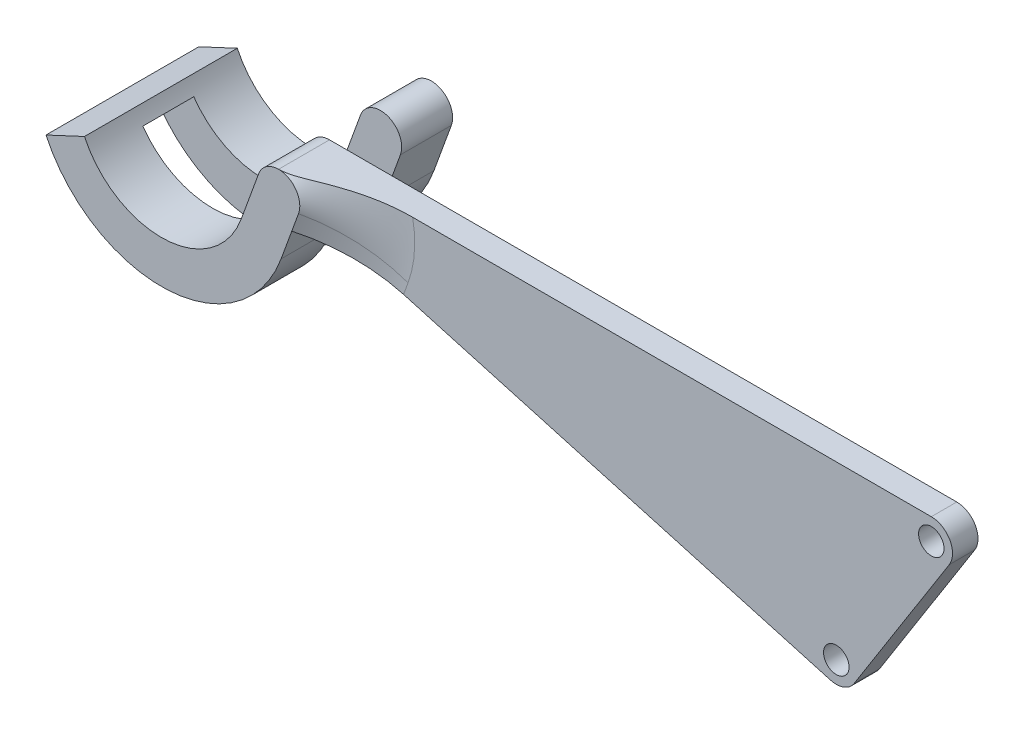
ISO-10303-21;
HEADER;
FILE_DESCRIPTION(('STEP AP214'),'2;1');
FILE_NAME('part.step','',(''),(''),'','','');
FILE_SCHEMA(('AUTOMOTIVE_DESIGN { 1 0 10303 214 1 1 1 1 }'));
ENDSEC;
DATA;
#1=APPLICATION_CONTEXT('core data for automotive mechanical design processes');
#2=APPLICATION_PROTOCOL_DEFINITION('international standard','automotive_design',2000,#1);
#3=PRODUCT_CONTEXT('',#1,'mechanical');
#4=PRODUCT('Part','Part','',(#3));
#5=PRODUCT_RELATED_PRODUCT_CATEGORY('part','',(#4));
#6=PRODUCT_DEFINITION_FORMATION('','',#4);
#7=PRODUCT_DEFINITION_CONTEXT('part definition',#1,'design');
#8=PRODUCT_DEFINITION('design','',#6,#7);
#9=PRODUCT_DEFINITION_SHAPE('','',#8);
#10=(LENGTH_UNIT() NAMED_UNIT(*) SI_UNIT(.MILLI.,.METRE.));
#11=(NAMED_UNIT(*) PLANE_ANGLE_UNIT() SI_UNIT($,.RADIAN.));
#12=(NAMED_UNIT(*) SI_UNIT($,.STERADIAN.) SOLID_ANGLE_UNIT());
#13=UNCERTAINTY_MEASURE_WITH_UNIT(LENGTH_MEASURE(1.E-05),#10,'distance_accuracy_value','');
#14=(GEOMETRIC_REPRESENTATION_CONTEXT(3) GLOBAL_UNCERTAINTY_ASSIGNED_CONTEXT((#13)) GLOBAL_UNIT_ASSIGNED_CONTEXT((#10,
#11,#12)) REPRESENTATION_CONTEXT('',''));
#15=CARTESIAN_POINT('',(0.,0.,0.));
#16=DIRECTION('',(0.,0.,1.));
#17=DIRECTION('',(1.,0.,0.));
#18=AXIS2_PLACEMENT_3D('',#15,#16,#17);
#19=CARTESIAN_POINT('',(-1.17461577598238,0.427525179157091,-6.75));
#20=DIRECTION('',(-0.939692620785907,0.342020143325673,0.));
#21=DIRECTION('',(-0.342020143325673,-0.939692620785907,0.));
#22=AXIS2_PLACEMENT_3D('',#19,#20,#21);
#23=PLANE('',#22);
#24=DIRECTION('',(0.,0.,1.));
#25=VECTOR('',#24,1.);
#26=CARTESIAN_POINT('',(-1.17461577598238,0.427525179157091,-6.75));
#27=LINE('',#26,#25);
#28=CARTESIAN_POINT('',(-1.17461577598238,0.427525179157091,-0.75));
#29=VERTEX_POINT('',#28);
#30=CARTESIAN_POINT('',(-1.17461577598238,0.427525179157091,2.25));
#31=VERTEX_POINT('',#30);
#32=EDGE_CURVE('E211',#29,#31,#27,.T.);
#33=ORIENTED_EDGE('',*,*,#32,.F.);
#34=DIRECTION('',(0.342020143325673,0.939692620785907,0.));
#35=VECTOR('',#34,1.);
#36=CARTESIAN_POINT('',(-1.17461577598238,0.427525179157091,-0.75));
#37=LINE('',#36,#35);
#38=CARTESIAN_POINT('',(-2.2006762059594,-2.39155268320063,-0.75));
#39=VERTEX_POINT('',#38);
#40=EDGE_CURVE('E357',#39,#29,#37,.T.);
#41=ORIENTED_EDGE('',*,*,#40,.F.);
#42=DIRECTION('',(0.,0.,1.));
#43=VECTOR('',#42,1.);
#44=CARTESIAN_POINT('',(-2.2006762059594,-2.39155268320063,-6.75));
#45=LINE('',#44,#43);
#46=CARTESIAN_POINT('',(-2.2006762059594,-2.39155268320063,2.25));
#47=VERTEX_POINT('',#46);
#48=EDGE_CURVE('E195',#39,#47,#45,.T.);
#49=ORIENTED_EDGE('',*,*,#48,.T.);
#50=DIRECTION('',(-0.342020143325673,-0.939692620785907,0.));
#51=VECTOR('',#50,1.);
#52=CARTESIAN_POINT('',(-1.17461577598238,0.427525179157091,2.25));
#53=LINE('',#52,#51);
#54=EDGE_CURVE('E373',#31,#47,#53,.T.);
#55=ORIENTED_EDGE('',*,*,#54,.F.);
#56=EDGE_LOOP('',(#33,#41,#49,#55));
#57=FACE_BOUND('',#56,.T.);
#58=ADVANCED_FACE('F34',(#57),#23,.T.);
#59=CARTESIAN_POINT('',(1.17461577598238,-0.427525179157091,-6.75));
#60=DIRECTION('',(0.939692620785907,-0.342020143325673,0.));
#61=DIRECTION('',(0.342020143325673,0.939692620785907,0.));
#62=AXIS2_PLACEMENT_3D('',#59,#60,#61);
#63=PLANE('',#62);
#64=DIRECTION('',(0.,0.,-1.));
#65=VECTOR('',#64,1.);
#66=CARTESIAN_POINT('',(0.777572027577552,-1.51839391243497,0.75));
#67=LINE('',#66,#65);
#68=CARTESIAN_POINT('',(0.777572027577552,-1.51839391243497,2.25));
#69=VERTEX_POINT('',#68);
#70=CARTESIAN_POINT('',(0.777572027577552,-1.51839391243497,-0.75));
#71=VERTEX_POINT('',#70);
#72=EDGE_CURVE('E214',#69,#71,#67,.T.);
#73=ORIENTED_EDGE('',*,*,#72,.F.);
#74=DIRECTION('',(0.342020143325673,0.939692620785907,0.));
#75=VECTOR('',#74,1.);
#76=CARTESIAN_POINT('',(1.17461577598238,-0.427525179157091,2.25));
#77=LINE('',#76,#75);
#78=CARTESIAN_POINT('',(0.148555346005365,-3.24660304151481,2.25));
#79=VERTEX_POINT('',#78);
#80=EDGE_CURVE('E375',#79,#69,#77,.T.);
#81=ORIENTED_EDGE('',*,*,#80,.F.);
#82=DIRECTION('',(0.,0.,1.));
#83=VECTOR('',#82,1.);
#84=CARTESIAN_POINT('',(0.148555346005365,-3.24660304151481,-6.75));
#85=LINE('',#84,#83);
#86=CARTESIAN_POINT('',(0.148555346005365,-3.24660304151481,-0.75));
#87=VERTEX_POINT('',#86);
#88=EDGE_CURVE('E204',#87,#79,#85,.T.);
#89=ORIENTED_EDGE('',*,*,#88,.F.);
#90=DIRECTION('',(-0.342020143325673,-0.939692620785907,0.));
#91=VECTOR('',#90,1.);
#92=CARTESIAN_POINT('',(0.148555346005365,-3.24660304151481,-0.75));
#93=LINE('',#92,#91);
#94=EDGE_CURVE('E358',#71,#87,#93,.T.);
#95=ORIENTED_EDGE('',*,*,#94,.F.);
#96=EDGE_LOOP('',(#73,#81,#89,#95));
#97=FACE_BOUND('',#96,.T.);
#98=ADVANCED_FACE('F312',(#97),#63,.T.);
#99=CARTESIAN_POINT('',(0.,0.,0.75));
#100=DIRECTION('',(0.,0.,-1.));
#101=DIRECTION('',(-1.,0.,0.));
#102=AXIS2_PLACEMENT_3D('',#99,#100,#101);
#103=CYLINDRICAL_SURFACE('',#102,1.25);
#104=CARTESIAN_POINT('',(0.,0.,2.25));
#105=DIRECTION('',(0.,0.,-1.));
#106=DIRECTION('',(-1.,0.,0.));
#107=AXIS2_PLACEMENT_3D('',#104,#105,#106);
#108=CIRCLE('',#107,1.25);
#109=CARTESIAN_POINT('',(0.,1.25,2.25));
#110=VERTEX_POINT('',#109);
#111=EDGE_CURVE('E337',#31,#110,#108,.T.);
#112=ORIENTED_EDGE('',*,*,#111,.T.);
#113=DIRECTION('',(0.,0.,-1.));
#114=VECTOR('',#113,1.);
#115=CARTESIAN_POINT('',(0.,1.25,0.75));
#116=LINE('',#115,#114);
#117=CARTESIAN_POINT('',(0.,1.25,-0.75));
#118=VERTEX_POINT('',#117);
#119=EDGE_CURVE('E50',#110,#118,#116,.T.);
#120=ORIENTED_EDGE('',*,*,#119,.T.);
#121=CARTESIAN_POINT('',(0.,0.,-0.75));
#122=DIRECTION('',(0.,0.,-1.));
#123=DIRECTION('',(-1.,0.,0.));
#124=AXIS2_PLACEMENT_3D('',#121,#122,#123);
#125=CIRCLE('',#124,1.25);
#126=EDGE_CURVE('E355',#29,#118,#125,.T.);
#127=ORIENTED_EDGE('',*,*,#126,.F.);
#128=ORIENTED_EDGE('',*,*,#32,.T.);
#129=EDGE_LOOP('',(#112,#120,#127,#128));
#130=FACE_BOUND('',#129,.T.);
#131=ADVANCED_FACE('F302',(#130),#103,.T.);
#132=DIRECTION('',(0.342020143325673,0.939692620785907,0.));
#133=VECTOR('',#132,1.);
#134=CARTESIAN_POINT('',(-1.17461577598238,0.427525179157091,-3.75));
#135=LINE('',#134,#133);
#136=CARTESIAN_POINT('',(-2.2006762059594,-2.39155268320063,-3.75));
#137=VERTEX_POINT('',#136);
#138=CARTESIAN_POINT('',(-1.17461577598238,0.427525179157091,-3.75));
#139=VERTEX_POINT('',#138);
#140=EDGE_CURVE('E168',#137,#139,#135,.T.);
#141=ORIENTED_EDGE('',*,*,#140,.T.);
#142=CARTESIAN_POINT('',(-1.17461577598238,0.427525179157091,-6.75));
#143=VERTEX_POINT('',#142);
#144=EDGE_CURVE('E212',#143,#139,#27,.T.);
#145=ORIENTED_EDGE('',*,*,#144,.F.);
#146=DIRECTION('',(-0.342020143325673,-0.939692620785907,0.));
#147=VECTOR('',#146,1.);
#148=CARTESIAN_POINT('',(-1.17461577598238,0.427525179157091,-6.75));
#149=LINE('',#148,#147);
#150=CARTESIAN_POINT('',(-2.2006762059594,-2.39155268320063,-6.75));
#151=VERTEX_POINT('',#150);
#152=EDGE_CURVE('E192',#143,#151,#149,.T.);
#153=ORIENTED_EDGE('',*,*,#152,.T.);
#154=EDGE_CURVE('E183',#151,#137,#45,.T.);
#155=ORIENTED_EDGE('',*,*,#154,.T.);
#156=EDGE_LOOP('',(#141,#145,#153,#155));
#157=FACE_BOUND('',#156,.T.);
#158=ADVANCED_FACE('F190',(#157),#23,.T.);
#159=DIRECTION('',(-0.342020143325673,-0.939692620785907,0.));
#160=VECTOR('',#159,1.);
#161=CARTESIAN_POINT('',(0.148555346005365,-3.24660304151481,-3.75));
#162=LINE('',#161,#160);
#163=CARTESIAN_POINT('',(1.17461577598238,-0.427525179157091,-3.75));
#164=VERTEX_POINT('',#163);
#165=CARTESIAN_POINT('',(0.148555346005365,-3.24660304151481,-3.75));
#166=VERTEX_POINT('',#165);
#167=EDGE_CURVE('E414',#164,#166,#162,.T.);
#168=ORIENTED_EDGE('',*,*,#167,.T.);
#169=CARTESIAN_POINT('',(0.148555346005365,-3.24660304151481,-6.75));
#170=VERTEX_POINT('',#169);
#171=EDGE_CURVE('E205',#170,#166,#85,.T.);
#172=ORIENTED_EDGE('',*,*,#171,.F.);
#173=DIRECTION('',(0.342020143325673,0.939692620785907,0.));
#174=VECTOR('',#173,1.);
#175=CARTESIAN_POINT('',(1.17461577598238,-0.427525179157091,-6.75));
#176=LINE('',#175,#174);
#177=CARTESIAN_POINT('',(1.17461577598238,-0.427525179157091,-6.75));
#178=VERTEX_POINT('',#177);
#179=EDGE_CURVE('E390',#170,#178,#176,.T.);
#180=ORIENTED_EDGE('',*,*,#179,.T.);
#181=DIRECTION('',(0.,0.,1.));
#182=VECTOR('',#181,1.);
#183=CARTESIAN_POINT('',(1.17461577598238,-0.427525179157091,-6.75));
#184=LINE('',#183,#182);
#185=EDGE_CURVE('E208',#178,#164,#184,.T.);
#186=ORIENTED_EDGE('',*,*,#185,.T.);
#187=EDGE_LOOP('',(#168,#172,#180,#186));
#188=FACE_BOUND('',#187,.T.);
#189=ADVANCED_FACE('F321',(#188),#63,.T.);
#190=CARTESIAN_POINT('',(-6.89913930988894,-0.681451966572266,-6.75));
#191=DIRECTION('',(0.,0.,1.));
#192=DIRECTION('',(1.,0.,0.));
#193=AXIS2_PLACEMENT_3D('',#190,#191,#192);
#194=CYLINDRICAL_SURFACE('',#193,7.5);
#195=ORIENTED_EDGE('',*,*,#171,.T.);
#196=CARTESIAN_POINT('',(-6.89913930988894,-0.681451966572266,-3.75));
#197=DIRECTION('',(0.,0.,-1.));
#198=DIRECTION('',(-1.,0.,0.));
#199=AXIS2_PLACEMENT_3D('',#196,#197,#198);
#200=CIRCLE('',#199,7.5);
#201=CARTESIAN_POINT('',(-13.0427796420564,-4.98327523920506,-3.75));
#202=VERTEX_POINT('',#201);
#203=EDGE_CURVE('E411',#166,#202,#200,.T.);
#204=ORIENTED_EDGE('',*,*,#203,.T.);
#205=DIRECTION('',(0.,0.,1.));
#206=VECTOR('',#205,1.);
#207=CARTESIAN_POINT('',(-13.0427796420564,-4.98327523920506,-3.75));
#208=LINE('',#207,#206);
#209=CARTESIAN_POINT('',(-13.0427796420564,-4.98327523920506,-0.75));
#210=VERTEX_POINT('',#209);
#211=EDGE_CURVE('E369',#202,#210,#208,.T.);
#212=ORIENTED_EDGE('',*,*,#211,.T.);
#213=CARTESIAN_POINT('',(-6.89913930988894,-0.681451966572266,-0.75));
#214=DIRECTION('',(0.,0.,-1.));
#215=DIRECTION('',(-1.,0.,0.));
#216=AXIS2_PLACEMENT_3D('',#213,#214,#215);
#217=CIRCLE('',#216,7.5);
#218=EDGE_CURVE('E360',#87,#210,#217,.T.);
#219=ORIENTED_EDGE('',*,*,#218,.F.);
#220=ORIENTED_EDGE('',*,*,#88,.T.);
#221=CARTESIAN_POINT('',(-6.89913930988894,-0.681451966572266,2.25));
#222=DIRECTION('',(0.,0.,-1.));
#223=DIRECTION('',(-1.,0.,0.));
#224=AXIS2_PLACEMENT_3D('',#221,#222,#223);
#225=CIRCLE('',#224,7.5);
#226=CARTESIAN_POINT('',(-13.6964477126638,-3.85108892962745,2.25));
#227=VERTEX_POINT('',#226);
#228=EDGE_CURVE('E378',#79,#227,#225,.T.);
#229=ORIENTED_EDGE('',*,*,#228,.T.);
#230=DIRECTION('',(0.,0.,1.));
#231=VECTOR('',#230,1.);
#232=CARTESIAN_POINT('',(-13.6964477126638,-3.85108892962745,-6.75));
#233=LINE('',#232,#231);
#234=CARTESIAN_POINT('',(-13.6964477126638,-3.85108892962745,-6.75));
#235=VERTEX_POINT('',#234);
#236=EDGE_CURVE('E197',#235,#227,#233,.T.);
#237=ORIENTED_EDGE('',*,*,#236,.F.);
#238=CARTESIAN_POINT('',(-6.89913930988894,-0.681451966572266,-6.75));
#239=DIRECTION('',(0.,0.,-1.));
#240=DIRECTION('',(-1.,0.,0.));
#241=AXIS2_PLACEMENT_3D('',#238,#239,#240);
#242=CIRCLE('',#241,7.5);
#243=EDGE_CURVE('E393',#170,#235,#242,.T.);
#244=ORIENTED_EDGE('',*,*,#243,.F.);
#245=EDGE_LOOP('',(#195,#204,#212,#219,#220,#229,#237,#244));
#246=FACE_BOUND('',#245,.T.);
#247=ADVANCED_FACE('F329',(#246),#194,.T.);
#248=CARTESIAN_POINT('',(-0.971217775872857,2.08278324168129,-6.75));
#249=DIRECTION('',(-0.422618261740691,0.906307787036654,0.));
#250=DIRECTION('',(-0.906307787036654,-0.422618261740691,0.));
#251=AXIS2_PLACEMENT_3D('',#248,#249,#250);
#252=PLANE('',#251);
#253=ORIENTED_EDGE('',*,*,#236,.T.);
#254=DIRECTION('',(-0.906307787036654,-0.422618261740691,0.));
#255=VECTOR('',#254,1.);
#256=CARTESIAN_POINT('',(-0.971217775872857,2.08278324168129,2.25));
#257=LINE('',#256,#255);
#258=CARTESIAN_POINT('',(-11.4306782450722,-2.79454327527572,2.25));
#259=VERTEX_POINT('',#258);
#260=EDGE_CURVE('E381',#259,#227,#257,.T.);
#261=ORIENTED_EDGE('',*,*,#260,.F.);
#262=DIRECTION('',(0.,0.,1.));
#263=VECTOR('',#262,1.);
#264=CARTESIAN_POINT('',(-11.4306782450722,-2.79454327527572,-6.75));
#265=LINE('',#264,#263);
#266=CARTESIAN_POINT('',(-11.4306782450722,-2.79454327527572,-6.75));
#267=VERTEX_POINT('',#266);
#268=EDGE_CURVE('E194',#267,#259,#265,.T.);
#269=ORIENTED_EDGE('',*,*,#268,.F.);
#270=DIRECTION('',(-0.906307787036654,-0.422618261740691,0.));
#271=VECTOR('',#270,1.);
#272=CARTESIAN_POINT('',(-0.971217775872857,2.08278324168129,-6.75));
#273=LINE('',#272,#271);
#274=EDGE_CURVE('E394',#267,#235,#273,.T.);
#275=ORIENTED_EDGE('',*,*,#274,.T.);
#276=EDGE_LOOP('',(#253,#261,#269,#275));
#277=FACE_BOUND('',#276,.T.);
#278=ADVANCED_FACE('F407',(#277),#252,.T.);
#279=CARTESIAN_POINT('',(-6.89913930988894,-0.681451966572266,-6.75));
#280=DIRECTION('',(0.,0.,1.));
#281=DIRECTION('',(1.,0.,0.));
#282=AXIS2_PLACEMENT_3D('',#279,#280,#281);
#283=CYLINDRICAL_SURFACE('',#282,5.);
#284=CARTESIAN_POINT('',(-6.89913930988894,-0.681451966572266,-3.75));
#285=DIRECTION('',(0.,0.,1.));
#286=DIRECTION('',(-1.,0.,0.));
#287=AXIS2_PLACEMENT_3D('',#284,#285,#286);
#288=CIRCLE('',#287,5.);
#289=CARTESIAN_POINT('',(-10.9948995313339,-3.54933414832746,-3.75));
#290=VERTEX_POINT('',#289);
#291=EDGE_CURVE('E172',#290,#137,#288,.T.);
#292=ORIENTED_EDGE('',*,*,#291,.T.);
#293=ORIENTED_EDGE('',*,*,#154,.F.);
#294=CARTESIAN_POINT('',(-6.89913930988894,-0.681451966572266,-6.75));
#295=DIRECTION('',(0.,0.,-1.));
#296=DIRECTION('',(-1.,0.,0.));
#297=AXIS2_PLACEMENT_3D('',#294,#295,#296);
#298=CIRCLE('',#297,5.);
#299=EDGE_CURVE('E199',#151,#267,#298,.T.);
#300=ORIENTED_EDGE('',*,*,#299,.T.);
#301=ORIENTED_EDGE('',*,*,#268,.T.);
#302=CARTESIAN_POINT('',(-6.89913930988894,-0.681451966572266,2.25));
#303=DIRECTION('',(0.,0.,-1.));
#304=DIRECTION('',(-1.,0.,0.));
#305=AXIS2_PLACEMENT_3D('',#302,#303,#304);
#306=CIRCLE('',#305,5.);
#307=EDGE_CURVE('E384',#47,#259,#306,.T.);
#308=ORIENTED_EDGE('',*,*,#307,.F.);
#309=ORIENTED_EDGE('',*,*,#48,.F.);
#310=CARTESIAN_POINT('',(-6.89913930988894,-0.681451966572266,-0.75));
#311=DIRECTION('',(0.,0.,1.));
#312=DIRECTION('',(-1.,0.,0.));
#313=AXIS2_PLACEMENT_3D('',#310,#311,#312);
#314=CIRCLE('',#313,5.);
#315=CARTESIAN_POINT('',(-10.9948995313339,-3.54933414832746,-0.75));
#316=VERTEX_POINT('',#315);
#317=EDGE_CURVE('E362',#316,#39,#314,.T.);
#318=ORIENTED_EDGE('',*,*,#317,.F.);
#319=DIRECTION('',(0.,0.,1.));
#320=VECTOR('',#319,1.);
#321=CARTESIAN_POINT('',(-10.9948995313339,-3.54933414832746,-3.75));
#322=LINE('',#321,#320);
#323=EDGE_CURVE('E187',#290,#316,#322,.T.);
#324=ORIENTED_EDGE('',*,*,#323,.F.);
#325=EDGE_LOOP('',(#292,#293,#300,#301,#308,#309,#318,#324));
#326=FACE_BOUND('',#325,.T.);
#327=ADVANCED_FACE('F181',(#326),#283,.F.);
#328=CARTESIAN_POINT('',(0.,0.,-6.75));
#329=DIRECTION('',(0.,0.,-1.));
#330=DIRECTION('',(-1.,0.,0.));
#331=AXIS2_PLACEMENT_3D('',#328,#329,#330);
#332=PLANE('',#331);
#333=ORIENTED_EDGE('',*,*,#152,.F.);
#334=CARTESIAN_POINT('',(0.,0.,-6.75));
#335=DIRECTION('',(0.,0.,-1.));
#336=DIRECTION('',(-1.,0.,0.));
#337=AXIS2_PLACEMENT_3D('',#334,#335,#336);
#338=CIRCLE('',#337,1.25);
#339=EDGE_CURVE('E388',#143,#178,#338,.T.);
#340=ORIENTED_EDGE('',*,*,#339,.T.);
#341=ORIENTED_EDGE('',*,*,#179,.F.);
#342=ORIENTED_EDGE('',*,*,#243,.T.);
#343=ORIENTED_EDGE('',*,*,#274,.F.);
#344=ORIENTED_EDGE('',*,*,#299,.F.);
#345=EDGE_LOOP('',(#333,#340,#341,#342,#343,#344));
#346=FACE_BOUND('',#345,.T.);
#347=ADVANCED_FACE('F400',(#346),#332,.T.);
#348=CARTESIAN_POINT('',(0.,0.,2.25));
#349=DIRECTION('',(0.,0.,-1.));
#350=DIRECTION('',(-1.,0.,0.));
#351=AXIS2_PLACEMENT_3D('',#348,#349,#350);
#352=PLANE('',#351);
#353=ORIENTED_EDGE('',*,*,#54,.T.);
#354=ORIENTED_EDGE('',*,*,#307,.T.);
#355=ORIENTED_EDGE('',*,*,#260,.T.);
#356=ORIENTED_EDGE('',*,*,#228,.F.);
#357=ORIENTED_EDGE('',*,*,#80,.T.);
#358=CARTESIAN_POINT('',(1.17461577598238,-0.427525179157091,2.25));
#359=VERTEX_POINT('',#358);
#360=EDGE_CURVE('E343',#69,#359,#77,.T.);
#361=ORIENTED_EDGE('',*,*,#360,.T.);
#362=EDGE_CURVE('E344',#110,#359,#108,.T.);
#363=ORIENTED_EDGE('',*,*,#362,.F.);
#364=ORIENTED_EDGE('',*,*,#111,.F.);
#365=EDGE_LOOP('',(#353,#354,#355,#356,#357,#361,#363,#364));
#366=FACE_BOUND('',#365,.T.);
#367=ADVANCED_FACE('F300',(#366),#352,.F.);
#368=ORIENTED_EDGE('',*,*,#144,.T.);
#369=CARTESIAN_POINT('',(0.,0.,-3.75));
#370=DIRECTION('',(0.,0.,-1.));
#371=DIRECTION('',(-1.,0.,0.));
#372=AXIS2_PLACEMENT_3D('',#369,#370,#371);
#373=CIRCLE('',#372,1.25);
#374=EDGE_CURVE('E175',#139,#164,#373,.T.);
#375=ORIENTED_EDGE('',*,*,#374,.T.);
#376=ORIENTED_EDGE('',*,*,#185,.F.);
#377=ORIENTED_EDGE('',*,*,#339,.F.);
#378=EDGE_LOOP('',(#368,#375,#376,#377));
#379=FACE_BOUND('',#378,.T.);
#380=ADVANCED_FACE('F297',(#379),#103,.T.);
#381=CARTESIAN_POINT('',(0.,0.,0.75));
#382=DIRECTION('',(0.,0.,1.));
#383=DIRECTION('',(1.,0.,0.));
#384=AXIS2_PLACEMENT_3D('',#381,#382,#383);
#385=PLANE('',#384);
#386=CARTESIAN_POINT('',(31.3447157552788,-8.84950248436459,0.75));
#387=DIRECTION('',(0.,0.,1.));
#388=DIRECTION('',(1.,0.,0.));
#389=AXIS2_PLACEMENT_3D('',#386,#387,#388);
#390=CIRCLE('',#389,0.749999999999999);
#391=CARTESIAN_POINT('',(32.0947157552788,-8.84950248436459,0.75));
#392=VERTEX_POINT('',#391);
#393=EDGE_CURVE('E221',#392,#392,#390,.T.);
#394=ORIENTED_EDGE('',*,*,#393,.F.);
#395=EDGE_LOOP('',(#394));
#396=FACE_BOUND('',#395,.T.);
#397=CARTESIAN_POINT('',(36.94,0.,0.75));
#398=DIRECTION('',(0.,0.,1.));
#399=DIRECTION('',(1.,0.,0.));
#400=AXIS2_PLACEMENT_3D('',#397,#398,#399);
#401=CIRCLE('',#400,0.749999999999999);
#402=CARTESIAN_POINT('',(37.69,0.,0.75));
#403=VERTEX_POINT('',#402);
#404=EDGE_CURVE('E217',#403,#403,#401,.T.);
#405=ORIENTED_EDGE('',*,*,#404,.F.);
#406=EDGE_LOOP('',(#405));
#407=FACE_BOUND('',#406,.T.);
#408=CARTESIAN_POINT('',(0.,0.,0.750000000000001));
#409=DIRECTION('',(0.,0.,1.));
#410=DIRECTION('',(1.,0.,0.));
#411=AXIS2_PLACEMENT_3D('',#408,#409,#410);
#412=CIRCLE('',#411,6.51782687642637);
#413=CARTESIAN_POINT('',(6.39684040687791,1.25,0.75));
#414=VERTEX_POINT('',#413);
#415=CARTESIAN_POINT('',(6.12475381933791,-2.22922808244727,0.75));
#416=VERTEX_POINT('',#415);
#417=EDGE_CURVE('E58',#414,#416,#412,.F.);
#418=ORIENTED_EDGE('',*,*,#417,.T.);
#419=DIRECTION('',(-0.342020143325673,-0.939692620785907,0.));
#420=VECTOR('',#419,1.);
#421=CARTESIAN_POINT('',(5.72771007093308,-3.32009681572515,0.75));
#422=LINE('',#421,#420);
#423=CARTESIAN_POINT('',(5.86109766407886,-2.95361741552171,0.75));
#424=VERTEX_POINT('',#423);
#425=EDGE_CURVE('E266',#416,#424,#422,.T.);
#426=ORIENTED_EDGE('',*,*,#425,.T.);
#427=DIRECTION('',(0.96237997406444,-0.271707168694031,0.));
#428=VECTOR('',#427,1.);
#429=CARTESIAN_POINT('',(-0.339633960867539,-1.20297496758055,0.75));
#430=LINE('',#429,#428);
#431=CARTESIAN_POINT('',(31.0050817944113,-10.0524774519451,0.75));
#432=VERTEX_POINT('',#431);
#433=EDGE_CURVE('E225',#424,#432,#430,.T.);
#434=ORIENTED_EDGE('',*,*,#433,.T.);
#435=CARTESIAN_POINT('',(31.3447157552788,-8.84950248436459,0.75));
#436=DIRECTION('',(0.,0.,1.));
#437=DIRECTION('',(1.,0.,0.));
#438=AXIS2_PLACEMENT_3D('',#435,#436,#437);
#439=CIRCLE('',#438,1.25000000000001);
#440=CARTESIAN_POINT('',(32.4012466153988,-9.51751636267419,0.75));
#441=VERTEX_POINT('',#440);
#442=EDGE_CURVE('E227',#432,#441,#439,.T.);
#443=ORIENTED_EDGE('',*,*,#442,.T.);
#444=DIRECTION('',(-0.534411102647676,-0.84522468809595,0.));
#445=VECTOR('',#444,1.);
#446=CARTESIAN_POINT('',(37.9965308601199,-0.668013878309598,0.75));
#447=LINE('',#446,#445);
#448=CARTESIAN_POINT('',(37.9965308601199,-0.668013878309596,0.75));
#449=VERTEX_POINT('',#448);
#450=EDGE_CURVE('E230',#449,#441,#447,.T.);
#451=ORIENTED_EDGE('',*,*,#450,.F.);
#452=CARTESIAN_POINT('',(36.94,0.,0.75));
#453=DIRECTION('',(0.,0.,1.));
#454=DIRECTION('',(1.,0.,0.));
#455=AXIS2_PLACEMENT_3D('',#452,#453,#454);
#456=CIRCLE('',#455,1.25);
#457=CARTESIAN_POINT('',(36.94,1.25,0.75));
#458=VERTEX_POINT('',#457);
#459=EDGE_CURVE('E233',#449,#458,#456,.T.);
#460=ORIENTED_EDGE('',*,*,#459,.T.);
#461=DIRECTION('',(1.,0.,0.));
#462=VECTOR('',#461,1.);
#463=CARTESIAN_POINT('',(0.,1.25,0.75));
#464=LINE('',#463,#462);
#465=EDGE_CURVE('E236',#414,#458,#464,.T.);
#466=ORIENTED_EDGE('',*,*,#465,.F.);
#467=EDGE_LOOP('',(#418,#426,#434,#443,#451,#460,#466));
#468=FACE_BOUND('',#467,.T.);
#469=ADVANCED_FACE('F299',(#396,#407,#468),#385,.T.);
#470=CARTESIAN_POINT('',(0.,0.,-0.75));
#471=DIRECTION('',(0.,0.,1.));
#472=DIRECTION('',(1.,0.,0.));
#473=AXIS2_PLACEMENT_3D('',#470,#471,#472);
#474=PLANE('',#473);
#475=CARTESIAN_POINT('',(31.3447157552788,-8.84950248436459,-0.750000000000001));
#476=DIRECTION('',(0.,0.,1.));
#477=DIRECTION('',(1.,0.,0.));
#478=AXIS2_PLACEMENT_3D('',#475,#476,#477);
#479=CIRCLE('',#478,0.749999999999999);
#480=CARTESIAN_POINT('',(32.0947157552788,-8.84950248436459,-0.750000000000001));
#481=VERTEX_POINT('',#480);
#482=EDGE_CURVE('E224',#481,#481,#479,.T.);
#483=ORIENTED_EDGE('',*,*,#482,.T.);
#484=EDGE_LOOP('',(#483));
#485=FACE_BOUND('',#484,.T.);
#486=CARTESIAN_POINT('',(36.94,0.,-0.750000000000001));
#487=DIRECTION('',(0.,0.,1.));
#488=DIRECTION('',(1.,0.,0.));
#489=AXIS2_PLACEMENT_3D('',#486,#487,#488);
#490=CIRCLE('',#489,0.749999999999999);
#491=CARTESIAN_POINT('',(37.69,0.,-0.750000000000001));
#492=VERTEX_POINT('',#491);
#493=EDGE_CURVE('E220',#492,#492,#490,.T.);
#494=ORIENTED_EDGE('',*,*,#493,.T.);
#495=EDGE_LOOP('',(#494));
#496=FACE_BOUND('',#495,.T.);
#497=ORIENTED_EDGE('',*,*,#126,.T.);
#498=DIRECTION('',(1.,0.,0.));
#499=VECTOR('',#498,1.);
#500=CARTESIAN_POINT('',(0.,1.25,-0.75));
#501=LINE('',#500,#499);
#502=CARTESIAN_POINT('',(36.94,1.25,-0.75));
#503=VERTEX_POINT('',#502);
#504=EDGE_CURVE('E228',#118,#503,#501,.T.);
#505=ORIENTED_EDGE('',*,*,#504,.T.);
#506=CARTESIAN_POINT('',(36.94,0.,-0.75));
#507=DIRECTION('',(0.,0.,1.));
#508=DIRECTION('',(1.,0.,0.));
#509=AXIS2_PLACEMENT_3D('',#506,#507,#508);
#510=CIRCLE('',#509,1.25);
#511=CARTESIAN_POINT('',(37.9965308601199,-0.668013878309596,-0.75));
#512=VERTEX_POINT('',#511);
#513=EDGE_CURVE('E246',#512,#503,#510,.T.);
#514=ORIENTED_EDGE('',*,*,#513,.F.);
#515=DIRECTION('',(-0.534411102647676,-0.84522468809595,0.));
#516=VECTOR('',#515,1.);
#517=CARTESIAN_POINT('',(37.9965308601199,-0.668013878309598,-0.75));
#518=LINE('',#517,#516);
#519=CARTESIAN_POINT('',(32.4012466153988,-9.51751636267419,-0.75));
#520=VERTEX_POINT('',#519);
#521=EDGE_CURVE('E243',#512,#520,#518,.T.);
#522=ORIENTED_EDGE('',*,*,#521,.T.);
#523=CARTESIAN_POINT('',(31.3447157552788,-8.84950248436459,-0.75));
#524=DIRECTION('',(0.,0.,1.));
#525=DIRECTION('',(1.,0.,0.));
#526=AXIS2_PLACEMENT_3D('',#523,#524,#525);
#527=CIRCLE('',#526,1.25000000000001);
#528=CARTESIAN_POINT('',(31.0050817944113,-10.0524774519451,-0.75));
#529=VERTEX_POINT('',#528);
#530=EDGE_CURVE('E240',#529,#520,#527,.T.);
#531=ORIENTED_EDGE('',*,*,#530,.F.);
#532=DIRECTION('',(0.96237997406444,-0.271707168694031,0.));
#533=VECTOR('',#532,1.);
#534=CARTESIAN_POINT('',(-0.339633960867539,-1.20297496758055,-0.75));
#535=LINE('',#534,#533);
#536=EDGE_CURVE('E238',#71,#529,#535,.T.);
#537=ORIENTED_EDGE('',*,*,#536,.F.);
#538=ORIENTED_EDGE('',*,*,#94,.T.);
#539=ORIENTED_EDGE('',*,*,#218,.T.);
#540=DIRECTION('',(0.819152044288997,0.573576436351039,0.));
#541=VECTOR('',#540,1.);
#542=CARTESIAN_POINT('',(-10.9948995313339,-3.54933414832746,-0.75));
#543=LINE('',#542,#541);
#544=EDGE_CURVE('E188',#210,#316,#543,.T.);
#545=ORIENTED_EDGE('',*,*,#544,.T.);
#546=ORIENTED_EDGE('',*,*,#317,.T.);
#547=ORIENTED_EDGE('',*,*,#40,.T.);
#548=EDGE_LOOP('',(#497,#505,#514,#522,#531,#537,#538,#539,#545,#546,#547));
#549=FACE_BOUND('',#548,.T.);
#550=ADVANCED_FACE('F280',(#485,#496,#549),#474,.F.);
#551=CARTESIAN_POINT('',(-0.339633960867539,-1.20297496758055,0.75));
#552=DIRECTION('',(0.271707168694031,0.962379974064441,0.));
#553=DIRECTION('',(-0.962379974064441,0.271707168694031,0.));
#554=AXIS2_PLACEMENT_3D('',#551,#552,#553);
#555=PLANE('',#554);
#556=ORIENTED_EDGE('',*,*,#433,.F.);
#557=CARTESIAN_POINT('',(5.86109766407887,-2.95361741552172,10.75));
#558=DIRECTION('',(0.271707168694031,0.962379974064441,0.));
#559=DIRECTION('',(0.962379974064441,-0.271707168694031,0.));
#560=AXIS2_PLACEMENT_3D('',#557,#558,#559);
#561=ELLIPSE('',#560,10.0273678474838,10.);
#562=EDGE_CURVE('E44',#424,#69,#561,.T.);
#563=ORIENTED_EDGE('',*,*,#562,.T.);
#564=ORIENTED_EDGE('',*,*,#72,.T.);
#565=ORIENTED_EDGE('',*,*,#536,.T.);
#566=DIRECTION('',(0.,0.,-1.));
#567=VECTOR('',#566,1.);
#568=CARTESIAN_POINT('',(31.0050817944113,-10.0524774519451,0.75));
#569=LINE('',#568,#567);
#570=EDGE_CURVE('E258',#432,#529,#569,.T.);
#571=ORIENTED_EDGE('',*,*,#570,.F.);
#572=EDGE_LOOP('',(#556,#563,#564,#565,#571));
#573=FACE_BOUND('',#572,.T.);
#574=ADVANCED_FACE('F292',(#573),#555,.F.);
#575=CARTESIAN_POINT('',(31.3447157552788,-8.84950248436459,0.75));
#576=DIRECTION('',(0.,0.,-1.));
#577=DIRECTION('',(-1.,0.,0.));
#578=AXIS2_PLACEMENT_3D('',#575,#576,#577);
#579=CYLINDRICAL_SURFACE('',#578,1.25000000000001);
#580=ORIENTED_EDGE('',*,*,#530,.T.);
#581=DIRECTION('',(0.,0.,-1.));
#582=VECTOR('',#581,1.);
#583=CARTESIAN_POINT('',(32.4012466153988,-9.51751636267419,0.75));
#584=LINE('',#583,#582);
#585=EDGE_CURVE('E256',#441,#520,#584,.T.);
#586=ORIENTED_EDGE('',*,*,#585,.F.);
#587=ORIENTED_EDGE('',*,*,#442,.F.);
#588=ORIENTED_EDGE('',*,*,#570,.T.);
#589=EDGE_LOOP('',(#580,#586,#587,#588));
#590=FACE_BOUND('',#589,.T.);
#591=ADVANCED_FACE('F288',(#590),#579,.T.);
#592=CARTESIAN_POINT('',(37.9965308601199,-0.668013878309598,0.75));
#593=DIRECTION('',(0.84522468809595,-0.534411102647676,0.));
#594=DIRECTION('',(0.534411102647676,0.84522468809595,0.));
#595=AXIS2_PLACEMENT_3D('',#592,#593,#594);
#596=PLANE('',#595);
#597=ORIENTED_EDGE('',*,*,#521,.F.);
#598=DIRECTION('',(0.,0.,-1.));
#599=VECTOR('',#598,1.);
#600=CARTESIAN_POINT('',(37.9965308601199,-0.668013878309596,0.75));
#601=LINE('',#600,#599);
#602=EDGE_CURVE('E254',#449,#512,#601,.T.);
#603=ORIENTED_EDGE('',*,*,#602,.F.);
#604=ORIENTED_EDGE('',*,*,#450,.T.);
#605=ORIENTED_EDGE('',*,*,#585,.T.);
#606=EDGE_LOOP('',(#597,#603,#604,#605));
#607=FACE_BOUND('',#606,.T.);
#608=ADVANCED_FACE('F284',(#607),#596,.T.);
#609=CARTESIAN_POINT('',(36.94,0.,0.75));
#610=DIRECTION('',(0.,0.,-1.));
#611=DIRECTION('',(-1.,0.,0.));
#612=AXIS2_PLACEMENT_3D('',#609,#610,#611);
#613=CYLINDRICAL_SURFACE('',#612,1.25);
#614=ORIENTED_EDGE('',*,*,#513,.T.);
#615=DIRECTION('',(0.,0.,-1.));
#616=VECTOR('',#615,1.);
#617=CARTESIAN_POINT('',(36.94,1.25,0.75));
#618=LINE('',#617,#616);
#619=EDGE_CURVE('E252',#458,#503,#618,.T.);
#620=ORIENTED_EDGE('',*,*,#619,.F.);
#621=ORIENTED_EDGE('',*,*,#459,.F.);
#622=ORIENTED_EDGE('',*,*,#602,.T.);
#623=EDGE_LOOP('',(#614,#620,#621,#622));
#624=FACE_BOUND('',#623,.T.);
#625=ADVANCED_FACE('F279',(#624),#613,.T.);
#626=CARTESIAN_POINT('',(0.,1.25,0.75));
#627=DIRECTION('',(0.,1.,0.));
#628=DIRECTION('',(0.,0.,1.));
#629=AXIS2_PLACEMENT_3D('',#626,#627,#628);
#630=PLANE('',#629);
#631=ORIENTED_EDGE('',*,*,#504,.F.);
#632=ORIENTED_EDGE('',*,*,#119,.F.);
#633=CARTESIAN_POINT('',(0.,1.25,2.25));
#634=CARTESIAN_POINT('',(0.0352754586982653,1.25,2.25001196701882));
#635=CARTESIAN_POINT('',(0.0705464885775799,1.25,2.24907483864719));
#636=CARTESIAN_POINT('',(0.140975940386694,1.25,2.24539261174675));
#637=CARTESIAN_POINT('',(0.176134412272241,1.25,2.2426484760671));
#638=CARTESIAN_POINT('',(0.246085554466282,1.25,2.23546150945201));
#639=CARTESIAN_POINT('',(0.280879175613019,1.25,2.23102782370966));
#640=CARTESIAN_POINT('',(0.350235213352563,1.25,2.22061483488292));
#641=CARTESIAN_POINT('',(0.384797600420039,1.25,2.21463533814346));
#642=CARTESIAN_POINT('',(0.487830159109886,1.25,2.19469399720041));
#643=CARTESIAN_POINT('',(0.555910456797701,1.25,2.17869952866002));
#644=CARTESIAN_POINT('',(0.657258302433045,1.25,2.15173178615965));
#645=CARTESIAN_POINT('',(0.690940370964796,1.25,2.14223721898943));
#646=CARTESIAN_POINT('',(0.758060185333932,1.25,2.1224228732234));
#647=CARTESIAN_POINT('',(0.791497947567263,1.25,2.11210315057126));
#648=CARTESIAN_POINT('',(0.895951738661193,1.25,2.07871267409801));
#649=CARTESIAN_POINT('',(0.966585255197821,1.25,2.05445206231322));
#650=CARTESIAN_POINT('',(1.10719085025765,1.25,2.00407500830387));
#651=CARTESIAN_POINT('',(1.17716278004891,1.25,1.97795815951198));
#652=CARTESIAN_POINT('',(1.316765308966,1.25,1.92470747573009));
#653=CARTESIAN_POINT('',(1.38639567150035,1.25,1.89757302469241));
#654=CARTESIAN_POINT('',(1.52550110882658,1.25,1.8429076540354));
#655=CARTESIAN_POINT('',(1.59497617945898,1.25,1.81537672393999));
#656=CARTESIAN_POINT('',(1.80351242023068,1.25,1.7328503188367));
#657=CARTESIAN_POINT('',(1.94261271671546,1.25,1.67794983617603));
#658=CARTESIAN_POINT('',(2.22174443964933,1.25,1.5706936029111));
#659=CARTESIAN_POINT('',(2.36177550874702,1.25,1.51833693332306));
#660=CARTESIAN_POINT('',(2.64349385525639,1.25,1.41731718077236));
#661=CARTESIAN_POINT('',(2.78518391376519,1.25,1.36866179736276));
#662=CARTESIAN_POINT('',(3.07009558734128,1.25,1.27598199044058));
#663=CARTESIAN_POINT('',(3.21331737412531,1.25,1.23195809227204));
#664=CARTESIAN_POINT('',(3.50127043814934,1.25,1.14909407133265));
#665=CARTESIAN_POINT('',(3.6460018304935,1.25,1.11025434700534));
#666=CARTESIAN_POINT('',(3.93684681301466,1.25,1.03815214328508));
#667=CARTESIAN_POINT('',(4.08296038419505,1.25,1.00488958735697));
#668=CARTESIAN_POINT('',(4.40586312211723,1.25,0.938136002690319));
#669=CARTESIAN_POINT('',(4.58292221062462,1.25,0.905939488124818));
#670=CARTESIAN_POINT('',(4.93835288511882,1.25,0.850366387687536));
#671=CARTESIAN_POINT('',(5.11672396078484,1.25,0.826986540063171));
#672=CARTESIAN_POINT('',(5.47838757226139,1.25,0.78886706628032));
#673=CARTESIAN_POINT('',(5.66170161092229,1.25,0.774330274266797));
#674=CARTESIAN_POINT('',(6.02895463259068,1.25,0.754887693179612));
#675=CARTESIAN_POINT('',(6.21289393734284,1.25,0.74998799670317));
#676=CARTESIAN_POINT('',(6.39684040687791,1.25,0.750000000000001));
#677=B_SPLINE_CURVE_WITH_KNOTS('',3,(#633,#634,#635,#636,#637,#638,#639,#640,#641,#642,#643,
#644,#645,#646,#647,#648,#649,#650,#651,#652,#653,#654,#655,#656,#657,#658,#659,#660,#661,#662,
#663,#664,#665,#666,#667,#668,#669,#670,#671,#672,#673,#674,#675,#676),.UNSPECIFIED.,.F.,.F.,(4,
2,2,2,2,2,2,2,2,2,2,2,2,2,2,2,2,2,2,2,2,4),(0.,0.105806771901535,0.211557211094939,
0.316743193259565,0.421942359233257,0.631543980053683,0.736522900681966,0.841494710002296,
1.06549570380497,1.28954591213168,1.51373402035421,1.73792806315896,2.18654830675861,
2.63500525699418,3.08437094628164,3.53378755177037,3.98323867850889,4.43268363695124,
4.9723505748092,5.51181766492936,6.06323297876332,6.61499678690529),.UNSPECIFIED.);
#678=EDGE_CURVE('E11',#110,#414,#677,.T.);
#679=ORIENTED_EDGE('',*,*,#678,.T.);
#680=ORIENTED_EDGE('',*,*,#465,.T.);
#681=ORIENTED_EDGE('',*,*,#619,.T.);
#682=EDGE_LOOP('',(#631,#632,#679,#680,#681));
#683=FACE_BOUND('',#682,.T.);
#684=ADVANCED_FACE('F273',(#683),#630,.T.);
#685=CARTESIAN_POINT('',(31.3447157552788,-8.84950248436459,-10.75));
#686=DIRECTION('',(0.,0.,1.));
#687=DIRECTION('',(1.,0.,0.));
#688=AXIS2_PLACEMENT_3D('',#685,#686,#687);
#689=CYLINDRICAL_SURFACE('',#688,0.749999999999999);
#690=ORIENTED_EDGE('',*,*,#393,.T.);
#691=EDGE_LOOP('',(#690));
#692=FACE_BOUND('',#691,.T.);
#693=ORIENTED_EDGE('',*,*,#482,.F.);
#694=EDGE_LOOP('',(#693));
#695=FACE_BOUND('',#694,.T.);
#696=ADVANCED_FACE('F278',(#692,#695),#689,.F.);
#697=CARTESIAN_POINT('',(36.94,0.,-10.75));
#698=DIRECTION('',(0.,0.,1.));
#699=DIRECTION('',(1.,0.,0.));
#700=AXIS2_PLACEMENT_3D('',#697,#698,#699);
#701=CYLINDRICAL_SURFACE('',#700,0.749999999999999);
#702=ORIENTED_EDGE('',*,*,#404,.T.);
#703=EDGE_LOOP('',(#702));
#704=FACE_BOUND('',#703,.T.);
#705=ORIENTED_EDGE('',*,*,#493,.F.);
#706=EDGE_LOOP('',(#705));
#707=FACE_BOUND('',#706,.T.);
#708=ADVANCED_FACE('F433',(#704,#707),#701,.F.);
#709=CARTESIAN_POINT('',(-10.9948995313339,-3.54933414832746,-3.75));
#710=DIRECTION('',(0.573576436351039,-0.819152044288997,0.));
#711=DIRECTION('',(0.819152044288997,0.573576436351039,0.));
#712=AXIS2_PLACEMENT_3D('',#709,#710,#711);
#713=PLANE('',#712);
#714=ORIENTED_EDGE('',*,*,#544,.F.);
#715=ORIENTED_EDGE('',*,*,#211,.F.);
#716=DIRECTION('',(0.819152044288997,0.573576436351039,0.));
#717=VECTOR('',#716,1.);
#718=CARTESIAN_POINT('',(-10.9948995313339,-3.54933414832746,-3.75));
#719=LINE('',#718,#717);
#720=EDGE_CURVE('E370',#202,#290,#719,.T.);
#721=ORIENTED_EDGE('',*,*,#720,.T.);
#722=ORIENTED_EDGE('',*,*,#323,.T.);
#723=EDGE_LOOP('',(#714,#715,#721,#722));
#724=FACE_BOUND('',#723,.T.);
#725=ADVANCED_FACE('F422',(#724),#713,.T.);
#726=CARTESIAN_POINT('',(-6.89913930988894,-0.681451966572266,-3.75));
#727=DIRECTION('',(0.,0.,-1.));
#728=DIRECTION('',(-1.,0.,0.));
#729=AXIS2_PLACEMENT_3D('',#726,#727,#728);
#730=PLANE('',#729);
#731=ORIENTED_EDGE('',*,*,#291,.F.);
#732=ORIENTED_EDGE('',*,*,#720,.F.);
#733=ORIENTED_EDGE('',*,*,#203,.F.);
#734=ORIENTED_EDGE('',*,*,#167,.F.);
#735=ORIENTED_EDGE('',*,*,#374,.F.);
#736=ORIENTED_EDGE('',*,*,#140,.F.);
#737=EDGE_LOOP('',(#731,#732,#733,#734,#735,#736));
#738=FACE_BOUND('',#737,.T.);
#739=ADVANCED_FACE('F170',(#738),#730,.F.);
#740=CARTESIAN_POINT('',(0.,0.,10.75));
#741=DIRECTION('',(0.,0.,1.));
#742=DIRECTION('',(1.,0.,0.));
#743=AXIS2_PLACEMENT_3D('',#740,#741,#742);
#744=DEGENERATE_TOROIDAL_SURFACE('',#743,6.51782687642637,10.,.T.);
#745=ORIENTED_EDGE('',*,*,#678,.F.);
#746=ORIENTED_EDGE('',*,*,#362,.T.);
#747=CARTESIAN_POINT('',(6.12475381933791,-2.22922808244727,10.75));
#748=DIRECTION('',(0.342020143325673,0.939692620785907,0.));
#749=DIRECTION('',(-0.939692620785907,0.342020143325673,0.));
#750=AXIS2_PLACEMENT_3D('',#747,#748,#749);
#751=CIRCLE('',#750,10.);
#752=EDGE_CURVE('E39',#416,#359,#751,.T.);
#753=ORIENTED_EDGE('',*,*,#752,.F.);
#754=ORIENTED_EDGE('',*,*,#417,.F.);
#755=EDGE_LOOP('',(#745,#746,#753,#754));
#756=FACE_BOUND('',#755,.T.);
#757=ADVANCED_FACE('F36',(#756),#744,.F.);
#758=CARTESIAN_POINT('',(6.12475381933791,-2.22922808244727,10.75));
#759=DIRECTION('',(0.342020143325673,0.939692620785907,0.));
#760=DIRECTION('',(-0.939692620785907,0.342020143325673,0.));
#761=AXIS2_PLACEMENT_3D('',#758,#759,#760);
#762=CYLINDRICAL_SURFACE('',#761,10.);
#763=ORIENTED_EDGE('',*,*,#562,.F.);
#764=ORIENTED_EDGE('',*,*,#425,.F.);
#765=ORIENTED_EDGE('',*,*,#752,.T.);
#766=ORIENTED_EDGE('',*,*,#360,.F.);
#767=EDGE_LOOP('',(#763,#764,#765,#766));
#768=FACE_BOUND('',#767,.T.);
#769=ADVANCED_FACE('F303',(#768),#762,.F.);
#770=CLOSED_SHELL('',(#58,#98,#131,#158,#189,#247,#278,#327,#347,#367,#380,#469,#550,#574,#591,
#608,#625,#684,#696,#708,#725,#739,#757,#769));
#771=MANIFOLD_SOLID_BREP('B2',#770);
#772=ADVANCED_BREP_SHAPE_REPRESENTATION('',(#18,#771),#14);
#773=SHAPE_DEFINITION_REPRESENTATION(#9,#772);
ENDSEC;
END-ISO-10303-21;
